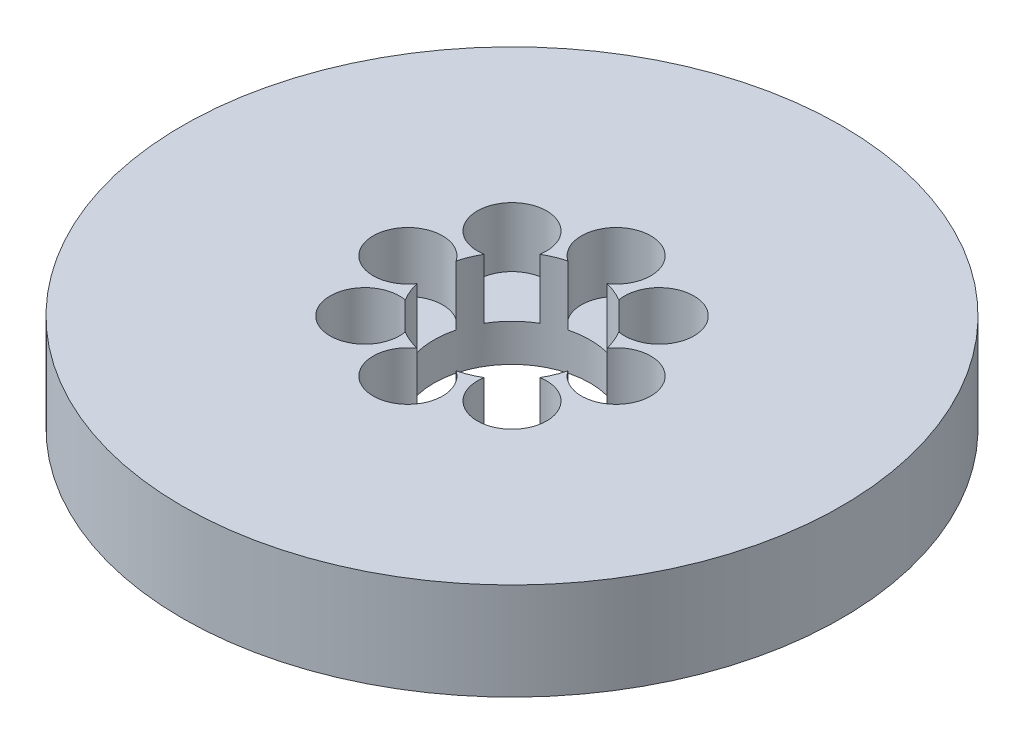
ISO-10303-21;
HEADER;
FILE_DESCRIPTION(('STEP AP214'),'2;1');
FILE_NAME('part.step','',(''),(''),'','','');
FILE_SCHEMA(('AUTOMOTIVE_DESIGN { 1 0 10303 214 1 1 1 1 }'));
ENDSEC;
DATA;
#1=APPLICATION_CONTEXT('core data for automotive mechanical design processes');
#2=APPLICATION_PROTOCOL_DEFINITION('international standard','automotive_design',2000,#1);
#3=PRODUCT_CONTEXT('',#1,'mechanical');
#4=PRODUCT('Part','Part','',(#3));
#5=PRODUCT_RELATED_PRODUCT_CATEGORY('part','',(#4));
#6=PRODUCT_DEFINITION_FORMATION('','',#4);
#7=PRODUCT_DEFINITION_CONTEXT('part definition',#1,'design');
#8=PRODUCT_DEFINITION('design','',#6,#7);
#9=PRODUCT_DEFINITION_SHAPE('','',#8);
#10=(LENGTH_UNIT() NAMED_UNIT(*) SI_UNIT(.MILLI.,.METRE.));
#11=(NAMED_UNIT(*) PLANE_ANGLE_UNIT() SI_UNIT($,.RADIAN.));
#12=(NAMED_UNIT(*) SI_UNIT($,.STERADIAN.) SOLID_ANGLE_UNIT());
#13=UNCERTAINTY_MEASURE_WITH_UNIT(LENGTH_MEASURE(1.E-05),#10,'distance_accuracy_value','');
#14=(GEOMETRIC_REPRESENTATION_CONTEXT(3) GLOBAL_UNCERTAINTY_ASSIGNED_CONTEXT((#13)) GLOBAL_UNIT_ASSIGNED_CONTEXT((#10,
#11,#12)) REPRESENTATION_CONTEXT('',''));
#15=CARTESIAN_POINT('',(0.,0.,0.));
#16=DIRECTION('',(0.,0.,1.));
#17=DIRECTION('',(1.,0.,0.));
#18=AXIS2_PLACEMENT_3D('',#15,#16,#17);
#19=CARTESIAN_POINT('',(0.,28.,0.));
#20=DIRECTION('',(0.,-1.,0.));
#21=DIRECTION('',(0.,0.,-1.));
#22=AXIS2_PLACEMENT_3D('',#19,#20,#21);
#23=CYLINDRICAL_SURFACE('',#22,95.);
#24=CARTESIAN_POINT('',(0.,28.,0.));
#25=DIRECTION('',(0.,1.,0.));
#26=DIRECTION('',(0.,0.,1.));
#27=AXIS2_PLACEMENT_3D('',#24,#25,#26);
#28=CIRCLE('',#27,95.);
#29=CARTESIAN_POINT('',(0.,28.,95.));
#30=VERTEX_POINT('',#29);
#31=EDGE_CURVE('E195',#30,#30,#28,.T.);
#32=ORIENTED_EDGE('',*,*,#31,.F.);
#33=EDGE_LOOP('',(#32));
#34=FACE_BOUND('',#33,.T.);
#35=CARTESIAN_POINT('',(0.,0.,0.));
#36=DIRECTION('',(0.,1.,0.));
#37=DIRECTION('',(0.,0.,1.));
#38=AXIS2_PLACEMENT_3D('',#35,#36,#37);
#39=CIRCLE('',#38,95.);
#40=CARTESIAN_POINT('',(0.,0.,95.));
#41=VERTEX_POINT('',#40);
#42=EDGE_CURVE('E179',#41,#41,#39,.T.);
#43=ORIENTED_EDGE('',*,*,#42,.T.);
#44=EDGE_LOOP('',(#43));
#45=FACE_BOUND('',#44,.T.);
#46=ADVANCED_FACE('F39',(#34,#45),#23,.T.);
#47=CARTESIAN_POINT('',(0.,28.,0.));
#48=DIRECTION('',(0.,1.,0.));
#49=DIRECTION('',(0.,0.,1.));
#50=AXIS2_PLACEMENT_3D('',#47,#48,#49);
#51=PLANE('',#50);
#52=CARTESIAN_POINT('',(1.04796170813175E-13,28.,30.0148162464182));
#53=DIRECTION('',(0.,1.,0.));
#54=DIRECTION('',(1.,0.,0.));
#55=AXIS2_PLACEMENT_3D('',#52,#53,#54);
#56=CIRCLE('',#55,10.);
#57=CARTESIAN_POINT('',(-5.66601857159565,28.,21.7748991627133));
#58=VERTEX_POINT('',#57);
#59=CARTESIAN_POINT('',(5.6660185715958,28.,21.7748991627133));
#60=VERTEX_POINT('',#59);
#61=EDGE_CURVE('E176',#58,#60,#56,.T.);
#62=ORIENTED_EDGE('',*,*,#61,.F.);
#63=CARTESIAN_POINT('',(0.,28.,0.));
#64=DIRECTION('',(0.,1.,0.));
#65=DIRECTION('',(0.,0.,1.));
#66=AXIS2_PLACEMENT_3D('',#63,#64,#65);
#67=CIRCLE('',#66,22.5);
#68=CARTESIAN_POINT('',(-11.3906987033036,28.,19.4036590119121));
#69=VERTEX_POINT('',#68);
#70=EDGE_CURVE('E166',#69,#58,#67,.T.);
#71=ORIENTED_EDGE('',*,*,#70,.F.);
#72=CARTESIAN_POINT('',(-21.2236801039105,28.,21.2236801039105));
#73=DIRECTION('',(0.,1.,0.));
#74=DIRECTION('',(0.707106781186549,0.,0.707106781186546));
#75=AXIS2_PLACEMENT_3D('',#72,#73,#74);
#76=CIRCLE('',#75,10.);
#77=CARTESIAN_POINT('',(-19.4036590119121,28.,11.3906987033036));
#78=VERTEX_POINT('',#77);
#79=EDGE_CURVE('E147',#78,#69,#76,.T.);
#80=ORIENTED_EDGE('',*,*,#79,.F.);
#81=CARTESIAN_POINT('',(-21.7748991627133,28.,5.66601857159572));
#82=VERTEX_POINT('',#81);
#83=EDGE_CURVE('E180',#82,#78,#67,.T.);
#84=ORIENTED_EDGE('',*,*,#83,.F.);
#85=CARTESIAN_POINT('',(-30.0148162464182,28.,0.));
#86=DIRECTION('',(0.,1.,0.));
#87=DIRECTION('',(0.,0.,1.));
#88=AXIS2_PLACEMENT_3D('',#85,#86,#87);
#89=CIRCLE('',#88,10.);
#90=CARTESIAN_POINT('',(-21.7748991627133,28.,-5.66601857159572));
#91=VERTEX_POINT('',#90);
#92=EDGE_CURVE('E186',#91,#82,#89,.T.);
#93=ORIENTED_EDGE('',*,*,#92,.F.);
#94=CARTESIAN_POINT('',(-19.4036590119122,28.,-11.3906987033034));
#95=VERTEX_POINT('',#94);
#96=EDGE_CURVE('E182',#95,#91,#67,.T.);
#97=ORIENTED_EDGE('',*,*,#96,.F.);
#98=CARTESIAN_POINT('',(-21.2236801039107,28.,-21.2236801039102));
#99=DIRECTION('',(0.,1.,0.));
#100=DIRECTION('',(-0.707106781186539,0.,0.707106781186556));
#101=AXIS2_PLACEMENT_3D('',#98,#99,#100);
#102=CIRCLE('',#101,10.);
#103=CARTESIAN_POINT('',(-11.3906987033038,28.,-19.403659011912));
#104=VERTEX_POINT('',#103);
#105=EDGE_CURVE('E446',#104,#95,#102,.T.);
#106=ORIENTED_EDGE('',*,*,#105,.F.);
#107=CARTESIAN_POINT('',(-5.66601857159595,28.,-21.7748991627132));
#108=VERTEX_POINT('',#107);
#109=EDGE_CURVE('E452',#108,#104,#67,.T.);
#110=ORIENTED_EDGE('',*,*,#109,.F.);
#111=CARTESIAN_POINT('',(-3.14388512439525E-13,28.,-30.0148162464182));
#112=DIRECTION('',(0.,1.,0.));
#113=DIRECTION('',(-1.,0.,0.));
#114=AXIS2_PLACEMENT_3D('',#111,#112,#113);
#115=CIRCLE('',#114,10.);
#116=CARTESIAN_POINT('',(5.66601857159549,28.,-21.7748991627134));
#117=VERTEX_POINT('',#116);
#118=EDGE_CURVE('E477',#117,#108,#115,.T.);
#119=ORIENTED_EDGE('',*,*,#118,.F.);
#120=CARTESIAN_POINT('',(11.3906987033034,28.,-19.4036590119122));
#121=VERTEX_POINT('',#120);
#122=EDGE_CURVE('E460',#121,#117,#67,.T.);
#123=ORIENTED_EDGE('',*,*,#122,.F.);
#124=CARTESIAN_POINT('',(21.2236801039103,28.,-21.2236801039107));
#125=DIRECTION('',(0.,1.,0.));
#126=DIRECTION('',(-0.707106781186554,0.,-0.707106781186541));
#127=AXIS2_PLACEMENT_3D('',#124,#125,#126);
#128=CIRCLE('',#127,10.);
#129=CARTESIAN_POINT('',(19.403659011912,28.,-11.3906987033038));
#130=VERTEX_POINT('',#129);
#131=EDGE_CURVE('E464',#130,#121,#128,.T.);
#132=ORIENTED_EDGE('',*,*,#131,.F.);
#133=CARTESIAN_POINT('',(21.7748991627133,28.,-5.66601857159572));
#134=VERTEX_POINT('',#133);
#135=EDGE_CURVE('E459',#134,#130,#67,.T.);
#136=ORIENTED_EDGE('',*,*,#135,.F.);
#137=CARTESIAN_POINT('',(30.0148162464182,28.,0.));
#138=DIRECTION('',(0.,1.,0.));
#139=DIRECTION('',(0.,0.,-1.));
#140=AXIS2_PLACEMENT_3D('',#137,#138,#139);
#141=CIRCLE('',#140,10.);
#142=CARTESIAN_POINT('',(21.7748991627133,28.,5.66601857159572));
#143=VERTEX_POINT('',#142);
#144=EDGE_CURVE('E469',#143,#134,#141,.T.);
#145=ORIENTED_EDGE('',*,*,#144,.F.);
#146=CARTESIAN_POINT('',(19.4036590119122,28.,11.3906987033035));
#147=VERTEX_POINT('',#146);
#148=EDGE_CURVE('E181',#147,#143,#67,.T.);
#149=ORIENTED_EDGE('',*,*,#148,.F.);
#150=CARTESIAN_POINT('',(21.2236801039106,28.,21.2236801039104));
#151=DIRECTION('',(0.,1.,0.));
#152=DIRECTION('',(0.707106781186544,0.,-0.707106781186551));
#153=AXIS2_PLACEMENT_3D('',#150,#151,#152);
#154=CIRCLE('',#153,10.);
#155=CARTESIAN_POINT('',(11.3906987033037,28.,19.403659011912));
#156=VERTEX_POINT('',#155);
#157=EDGE_CURVE('E475',#156,#147,#154,.T.);
#158=ORIENTED_EDGE('',*,*,#157,.F.);
#159=EDGE_CURVE('E177',#60,#156,#67,.T.);
#160=ORIENTED_EDGE('',*,*,#159,.F.);
#161=EDGE_LOOP('',(#62,#71,#80,#84,#93,#97,#106,#110,#119,#123,#132,#136,#145,#149,#158,#160));
#162=FACE_BOUND('',#161,.T.);
#163=ORIENTED_EDGE('',*,*,#31,.T.);
#164=EDGE_LOOP('',(#163));
#165=FACE_BOUND('',#164,.T.);
#166=ADVANCED_FACE('F172',(#162,#165),#51,.T.);
#167=CARTESIAN_POINT('',(0.,0.,0.));
#168=DIRECTION('',(0.,1.,0.));
#169=DIRECTION('',(0.,0.,1.));
#170=AXIS2_PLACEMENT_3D('',#167,#168,#169);
#171=PLANE('',#170);
#172=CARTESIAN_POINT('',(0.,0.,0.));
#173=DIRECTION('',(0.,1.,0.));
#174=DIRECTION('',(0.,0.,1.));
#175=AXIS2_PLACEMENT_3D('',#172,#173,#174);
#176=CIRCLE('',#175,22.5);
#177=CARTESIAN_POINT('',(0.,0.,22.5));
#178=VERTEX_POINT('',#177);
#179=EDGE_CURVE('E187',#178,#178,#176,.T.);
#180=ORIENTED_EDGE('',*,*,#179,.T.);
#181=EDGE_LOOP('',(#180));
#182=FACE_BOUND('',#181,.T.);
#183=ORIENTED_EDGE('',*,*,#42,.F.);
#184=EDGE_LOOP('',(#183));
#185=FACE_BOUND('',#184,.T.);
#186=ADVANCED_FACE('F270',(#182,#185),#171,.F.);
#187=CARTESIAN_POINT('',(0.,28.,0.));
#188=DIRECTION('',(0.,-1.,0.));
#189=DIRECTION('',(0.,0.,-1.));
#190=AXIS2_PLACEMENT_3D('',#187,#188,#189);
#191=CYLINDRICAL_SURFACE('',#190,22.5);
#192=DIRECTION('',(0.,1.,0.));
#193=VECTOR('',#192,1.);
#194=CARTESIAN_POINT('',(-5.66601857159565,19.384521507263,21.7748991627133));
#195=LINE('',#194,#193);
#196=CARTESIAN_POINT('',(-5.66601857159565,10.7690430145259,21.7748991627133));
#197=VERTEX_POINT('',#196);
#198=EDGE_CURVE('E11',#197,#58,#195,.T.);
#199=ORIENTED_EDGE('',*,*,#198,.F.);
#200=CARTESIAN_POINT('',(0.,10.7690430145259,0.));
#201=DIRECTION('',(0.,1.,0.));
#202=DIRECTION('',(0.,0.,1.));
#203=AXIS2_PLACEMENT_3D('',#200,#201,#202);
#204=CIRCLE('',#203,22.5);
#205=CARTESIAN_POINT('',(5.6660185715958,10.7690430145259,21.7748991627133));
#206=VERTEX_POINT('',#205);
#207=EDGE_CURVE('E250',#197,#206,#204,.T.);
#208=ORIENTED_EDGE('',*,*,#207,.T.);
#209=DIRECTION('',(0.,1.,0.));
#210=VECTOR('',#209,1.);
#211=CARTESIAN_POINT('',(5.6660185715958,19.384521507263,21.7748991627133));
#212=LINE('',#211,#210);
#213=EDGE_CURVE('E46',#60,#206,#212,.F.);
#214=ORIENTED_EDGE('',*,*,#213,.F.);
#215=ORIENTED_EDGE('',*,*,#159,.T.);
#216=DIRECTION('',(0.,1.,0.));
#217=VECTOR('',#216,1.);
#218=CARTESIAN_POINT('',(11.3906987033037,19.384521507263,19.403659011912));
#219=LINE('',#218,#217);
#220=CARTESIAN_POINT('',(11.3906987033037,10.7690430145259,19.403659011912));
#221=VERTEX_POINT('',#220);
#222=EDGE_CURVE('E244',#221,#156,#219,.T.);
#223=ORIENTED_EDGE('',*,*,#222,.F.);
#224=CARTESIAN_POINT('',(0.,10.7690430145259,0.));
#225=DIRECTION('',(0.,1.,0.));
#226=DIRECTION('',(0.,0.,1.));
#227=AXIS2_PLACEMENT_3D('',#224,#225,#226);
#228=CIRCLE('',#227,22.5);
#229=CARTESIAN_POINT('',(19.4036590119122,10.7690430145259,11.3906987033035));
#230=VERTEX_POINT('',#229);
#231=EDGE_CURVE('E238',#221,#230,#228,.T.);
#232=ORIENTED_EDGE('',*,*,#231,.T.);
#233=DIRECTION('',(0.,1.,0.));
#234=VECTOR('',#233,1.);
#235=CARTESIAN_POINT('',(19.4036590119122,19.384521507263,11.3906987033035));
#236=LINE('',#235,#234);
#237=EDGE_CURVE('E242',#147,#230,#236,.F.);
#238=ORIENTED_EDGE('',*,*,#237,.F.);
#239=ORIENTED_EDGE('',*,*,#148,.T.);
#240=DIRECTION('',(0.,1.,0.));
#241=VECTOR('',#240,1.);
#242=CARTESIAN_POINT('',(21.7748991627133,19.384521507263,5.66601857159572));
#243=LINE('',#242,#241);
#244=CARTESIAN_POINT('',(21.7748991627133,10.7690430145259,5.66601857159572));
#245=VERTEX_POINT('',#244);
#246=EDGE_CURVE('E236',#245,#143,#243,.T.);
#247=ORIENTED_EDGE('',*,*,#246,.F.);
#248=CARTESIAN_POINT('',(0.,10.7690430145259,0.));
#249=DIRECTION('',(0.,1.,0.));
#250=DIRECTION('',(0.,0.,1.));
#251=AXIS2_PLACEMENT_3D('',#248,#249,#250);
#252=CIRCLE('',#251,22.5);
#253=CARTESIAN_POINT('',(21.7748991627133,10.7690430145259,-5.66601857159572));
#254=VERTEX_POINT('',#253);
#255=EDGE_CURVE('E235',#245,#254,#252,.T.);
#256=ORIENTED_EDGE('',*,*,#255,.T.);
#257=DIRECTION('',(0.,1.,0.));
#258=VECTOR('',#257,1.);
#259=CARTESIAN_POINT('',(21.7748991627133,19.384521507263,-5.66601857159572));
#260=LINE('',#259,#258);
#261=EDGE_CURVE('E234',#134,#254,#260,.F.);
#262=ORIENTED_EDGE('',*,*,#261,.F.);
#263=ORIENTED_EDGE('',*,*,#135,.T.);
#264=DIRECTION('',(0.,1.,0.));
#265=VECTOR('',#264,1.);
#266=CARTESIAN_POINT('',(19.403659011912,19.384521507263,-11.3906987033038));
#267=LINE('',#266,#265);
#268=CARTESIAN_POINT('',(19.403659011912,10.7690430145259,-11.3906987033038));
#269=VERTEX_POINT('',#268);
#270=EDGE_CURVE('E229',#269,#130,#267,.T.);
#271=ORIENTED_EDGE('',*,*,#270,.F.);
#272=CARTESIAN_POINT('',(0.,10.7690430145259,0.));
#273=DIRECTION('',(0.,1.,0.));
#274=DIRECTION('',(0.,0.,1.));
#275=AXIS2_PLACEMENT_3D('',#272,#273,#274);
#276=CIRCLE('',#275,22.5);
#277=CARTESIAN_POINT('',(11.3906987033034,10.7690430145259,-19.4036590119122));
#278=VERTEX_POINT('',#277);
#279=EDGE_CURVE('E221',#269,#278,#276,.T.);
#280=ORIENTED_EDGE('',*,*,#279,.T.);
#281=DIRECTION('',(0.,1.,0.));
#282=VECTOR('',#281,1.);
#283=CARTESIAN_POINT('',(11.3906987033034,19.384521507263,-19.4036590119122));
#284=LINE('',#283,#282);
#285=EDGE_CURVE('E230',#121,#278,#284,.F.);
#286=ORIENTED_EDGE('',*,*,#285,.F.);
#287=ORIENTED_EDGE('',*,*,#122,.T.);
#288=DIRECTION('',(0.,1.,0.));
#289=VECTOR('',#288,1.);
#290=CARTESIAN_POINT('',(5.66601857159549,19.384521507263,-21.7748991627134));
#291=LINE('',#290,#289);
#292=CARTESIAN_POINT('',(5.66601857159549,10.7690430145259,-21.7748991627134));
#293=VERTEX_POINT('',#292);
#294=EDGE_CURVE('E225',#293,#117,#291,.T.);
#295=ORIENTED_EDGE('',*,*,#294,.F.);
#296=CARTESIAN_POINT('',(0.,10.7690430145259,0.));
#297=DIRECTION('',(0.,1.,0.));
#298=DIRECTION('',(0.,0.,1.));
#299=AXIS2_PLACEMENT_3D('',#296,#297,#298);
#300=CIRCLE('',#299,22.5);
#301=CARTESIAN_POINT('',(-5.66601857159595,10.7690430145259,-21.7748991627132));
#302=VERTEX_POINT('',#301);
#303=EDGE_CURVE('E216',#293,#302,#300,.T.);
#304=ORIENTED_EDGE('',*,*,#303,.T.);
#305=DIRECTION('',(0.,1.,0.));
#306=VECTOR('',#305,1.);
#307=CARTESIAN_POINT('',(-5.66601857159595,19.384521507263,-21.7748991627132));
#308=LINE('',#307,#306);
#309=EDGE_CURVE('E218',#108,#302,#308,.F.);
#310=ORIENTED_EDGE('',*,*,#309,.F.);
#311=ORIENTED_EDGE('',*,*,#109,.T.);
#312=DIRECTION('',(0.,1.,0.));
#313=VECTOR('',#312,1.);
#314=CARTESIAN_POINT('',(-11.3906987033038,19.384521507263,-19.403659011912));
#315=LINE('',#314,#313);
#316=CARTESIAN_POINT('',(-11.3906987033038,10.7690430145259,-19.403659011912));
#317=VERTEX_POINT('',#316);
#318=EDGE_CURVE('E212',#317,#104,#315,.T.);
#319=ORIENTED_EDGE('',*,*,#318,.F.);
#320=CARTESIAN_POINT('',(0.,10.7690430145259,0.));
#321=DIRECTION('',(0.,1.,0.));
#322=DIRECTION('',(0.,0.,1.));
#323=AXIS2_PLACEMENT_3D('',#320,#321,#322);
#324=CIRCLE('',#323,22.5);
#325=CARTESIAN_POINT('',(-19.4036590119122,10.7690430145259,-11.3906987033034));
#326=VERTEX_POINT('',#325);
#327=EDGE_CURVE('E208',#317,#326,#324,.T.);
#328=ORIENTED_EDGE('',*,*,#327,.T.);
#329=DIRECTION('',(0.,1.,0.));
#330=VECTOR('',#329,1.);
#331=CARTESIAN_POINT('',(-19.4036590119122,19.384521507263,-11.3906987033034));
#332=LINE('',#331,#330);
#333=EDGE_CURVE('E211',#95,#326,#332,.F.);
#334=ORIENTED_EDGE('',*,*,#333,.F.);
#335=ORIENTED_EDGE('',*,*,#96,.T.);
#336=DIRECTION('',(0.,1.,0.));
#337=VECTOR('',#336,1.);
#338=CARTESIAN_POINT('',(-21.7748991627133,19.384521507263,-5.66601857159572));
#339=LINE('',#338,#337);
#340=CARTESIAN_POINT('',(-21.7748991627133,10.7690430145259,-5.66601857159572));
#341=VERTEX_POINT('',#340);
#342=EDGE_CURVE('E201',#341,#91,#339,.T.);
#343=ORIENTED_EDGE('',*,*,#342,.F.);
#344=CARTESIAN_POINT('',(0.,10.7690430145259,0.));
#345=DIRECTION('',(0.,1.,0.));
#346=DIRECTION('',(0.,0.,1.));
#347=AXIS2_PLACEMENT_3D('',#344,#345,#346);
#348=CIRCLE('',#347,22.5);
#349=CARTESIAN_POINT('',(-21.7748991627133,10.7690430145259,5.66601857159572));
#350=VERTEX_POINT('',#349);
#351=EDGE_CURVE('E194',#341,#350,#348,.T.);
#352=ORIENTED_EDGE('',*,*,#351,.T.);
#353=DIRECTION('',(0.,1.,0.));
#354=VECTOR('',#353,1.);
#355=CARTESIAN_POINT('',(-21.7748991627133,19.384521507263,5.66601857159572));
#356=LINE('',#355,#354);
#357=EDGE_CURVE('E199',#82,#350,#356,.F.);
#358=ORIENTED_EDGE('',*,*,#357,.F.);
#359=ORIENTED_EDGE('',*,*,#83,.T.);
#360=DIRECTION('',(0.,1.,0.));
#361=VECTOR('',#360,1.);
#362=CARTESIAN_POINT('',(-19.4036590119121,19.384521507263,11.3906987033036));
#363=LINE('',#362,#361);
#364=CARTESIAN_POINT('',(-19.4036590119121,10.7690430145259,11.3906987033036));
#365=VERTEX_POINT('',#364);
#366=EDGE_CURVE('E160',#365,#78,#363,.T.);
#367=ORIENTED_EDGE('',*,*,#366,.F.);
#368=CARTESIAN_POINT('',(0.,10.7690430145259,0.));
#369=DIRECTION('',(0.,1.,0.));
#370=DIRECTION('',(0.,0.,1.));
#371=AXIS2_PLACEMENT_3D('',#368,#369,#370);
#372=CIRCLE('',#371,22.5);
#373=CARTESIAN_POINT('',(-11.3906987033036,10.7690430145259,19.4036590119121));
#374=VERTEX_POINT('',#373);
#375=EDGE_CURVE('E168',#365,#374,#372,.T.);
#376=ORIENTED_EDGE('',*,*,#375,.T.);
#377=DIRECTION('',(0.,1.,0.));
#378=VECTOR('',#377,1.);
#379=CARTESIAN_POINT('',(-11.3906987033036,19.384521507263,19.4036590119121));
#380=LINE('',#379,#378);
#381=EDGE_CURVE('E152',#69,#374,#380,.F.);
#382=ORIENTED_EDGE('',*,*,#381,.F.);
#383=ORIENTED_EDGE('',*,*,#70,.T.);
#384=EDGE_LOOP('',(#199,#208,#214,#215,#223,#232,#238,#239,#247,#256,#262,#263,#271,#280,#286,
#287,#295,#304,#310,#311,#319,#328,#334,#335,#343,#352,#358,#359,#367,#376,#382,#383));
#385=FACE_BOUND('',#384,.T.);
#386=ORIENTED_EDGE('',*,*,#179,.F.);
#387=EDGE_LOOP('',(#386));
#388=FACE_BOUND('',#387,.T.);
#389=ADVANCED_FACE('F170',(#385,#388),#191,.F.);
#390=CARTESIAN_POINT('',(-30.0148162464182,10.7690430145259,0.));
#391=DIRECTION('',(0.,1.,0.));
#392=DIRECTION('',(0.,0.,1.));
#393=AXIS2_PLACEMENT_3D('',#390,#391,#392);
#394=CYLINDRICAL_SURFACE('',#393,10.);
#395=ORIENTED_EDGE('',*,*,#342,.T.);
#396=ORIENTED_EDGE('',*,*,#92,.T.);
#397=ORIENTED_EDGE('',*,*,#357,.T.);
#398=CARTESIAN_POINT('',(-30.0148162464182,10.7690430145259,0.));
#399=DIRECTION('',(0.,1.,0.));
#400=DIRECTION('',(0.,0.,1.));
#401=AXIS2_PLACEMENT_3D('',#398,#399,#400);
#402=CIRCLE('',#401,10.);
#403=EDGE_CURVE('E191',#341,#350,#402,.T.);
#404=ORIENTED_EDGE('',*,*,#403,.F.);
#405=EDGE_LOOP('',(#395,#396,#397,#404));
#406=FACE_BOUND('',#405,.T.);
#407=ADVANCED_FACE('F279',(#406),#394,.F.);
#408=CARTESIAN_POINT('',(-30.0148162464182,10.7690430145259,0.));
#409=DIRECTION('',(0.,1.,0.));
#410=DIRECTION('',(0.,0.,1.));
#411=AXIS2_PLACEMENT_3D('',#408,#409,#410);
#412=PLANE('',#411);
#413=ORIENTED_EDGE('',*,*,#403,.T.);
#414=ORIENTED_EDGE('',*,*,#351,.F.);
#415=EDGE_LOOP('',(#413,#414));
#416=FACE_BOUND('',#415,.T.);
#417=ADVANCED_FACE('F285',(#416),#412,.T.);
#418=CARTESIAN_POINT('',(-21.2236801039105,10.7690430145259,21.2236801039105));
#419=DIRECTION('',(0.,1.,0.));
#420=DIRECTION('',(0.,0.,1.));
#421=AXIS2_PLACEMENT_3D('',#418,#419,#420);
#422=CYLINDRICAL_SURFACE('',#421,10.);
#423=ORIENTED_EDGE('',*,*,#366,.T.);
#424=ORIENTED_EDGE('',*,*,#79,.T.);
#425=ORIENTED_EDGE('',*,*,#381,.T.);
#426=CARTESIAN_POINT('',(-21.2236801039105,10.7690430145259,21.2236801039105));
#427=DIRECTION('',(0.,1.,0.));
#428=DIRECTION('',(0.707106781186549,0.,0.707106781186546));
#429=AXIS2_PLACEMENT_3D('',#426,#427,#428);
#430=CIRCLE('',#429,10.);
#431=EDGE_CURVE('E165',#365,#374,#430,.T.);
#432=ORIENTED_EDGE('',*,*,#431,.F.);
#433=EDGE_LOOP('',(#423,#424,#425,#432));
#434=FACE_BOUND('',#433,.T.);
#435=ADVANCED_FACE('F155',(#434),#422,.F.);
#436=CARTESIAN_POINT('',(-21.2236801039105,10.7690430145259,21.2236801039105));
#437=DIRECTION('',(0.,1.,0.));
#438=DIRECTION('',(0.707106781186549,0.,0.707106781186546));
#439=AXIS2_PLACEMENT_3D('',#436,#437,#438);
#440=PLANE('',#439);
#441=ORIENTED_EDGE('',*,*,#431,.T.);
#442=ORIENTED_EDGE('',*,*,#375,.F.);
#443=EDGE_LOOP('',(#441,#442));
#444=FACE_BOUND('',#443,.T.);
#445=ADVANCED_FACE('F288',(#444),#440,.T.);
#446=CARTESIAN_POINT('',(-21.2236801039107,10.7690430145259,-21.2236801039102));
#447=DIRECTION('',(0.,1.,0.));
#448=DIRECTION('',(0.,0.,1.));
#449=AXIS2_PLACEMENT_3D('',#446,#447,#448);
#450=CYLINDRICAL_SURFACE('',#449,10.);
#451=ORIENTED_EDGE('',*,*,#318,.T.);
#452=ORIENTED_EDGE('',*,*,#105,.T.);
#453=ORIENTED_EDGE('',*,*,#333,.T.);
#454=CARTESIAN_POINT('',(-21.2236801039107,10.7690430145259,-21.2236801039102));
#455=DIRECTION('',(0.,1.,0.));
#456=DIRECTION('',(-0.707106781186539,0.,0.707106781186556));
#457=AXIS2_PLACEMENT_3D('',#454,#455,#456);
#458=CIRCLE('',#457,10.);
#459=EDGE_CURVE('E447',#317,#326,#458,.T.);
#460=ORIENTED_EDGE('',*,*,#459,.F.);
#461=EDGE_LOOP('',(#451,#452,#453,#460));
#462=FACE_BOUND('',#461,.T.);
#463=ADVANCED_FACE('F295',(#462),#450,.F.);
#464=CARTESIAN_POINT('',(-21.2236801039107,10.7690430145259,-21.2236801039102));
#465=DIRECTION('',(0.,1.,0.));
#466=DIRECTION('',(-0.707106781186539,0.,0.707106781186556));
#467=AXIS2_PLACEMENT_3D('',#464,#465,#466);
#468=PLANE('',#467);
#469=ORIENTED_EDGE('',*,*,#459,.T.);
#470=ORIENTED_EDGE('',*,*,#327,.F.);
#471=EDGE_LOOP('',(#469,#470));
#472=FACE_BOUND('',#471,.T.);
#473=ADVANCED_FACE('F375',(#472),#468,.T.);
#474=CARTESIAN_POINT('',(-3.14388512439525E-13,10.7690430145259,-30.0148162464182));
#475=DIRECTION('',(0.,1.,0.));
#476=DIRECTION('',(0.,0.,1.));
#477=AXIS2_PLACEMENT_3D('',#474,#475,#476);
#478=CYLINDRICAL_SURFACE('',#477,10.);
#479=ORIENTED_EDGE('',*,*,#294,.T.);
#480=ORIENTED_EDGE('',*,*,#118,.T.);
#481=ORIENTED_EDGE('',*,*,#309,.T.);
#482=CARTESIAN_POINT('',(-3.14388512439525E-13,10.7690430145259,-30.0148162464182));
#483=DIRECTION('',(0.,1.,0.));
#484=DIRECTION('',(-1.,0.,0.));
#485=AXIS2_PLACEMENT_3D('',#482,#483,#484);
#486=CIRCLE('',#485,10.);
#487=EDGE_CURVE('E467',#293,#302,#486,.T.);
#488=ORIENTED_EDGE('',*,*,#487,.F.);
#489=EDGE_LOOP('',(#479,#480,#481,#488));
#490=FACE_BOUND('',#489,.T.);
#491=ADVANCED_FACE('F361',(#490),#478,.F.);
#492=CARTESIAN_POINT('',(-3.14388512439525E-13,10.7690430145259,-30.0148162464182));
#493=DIRECTION('',(0.,1.,0.));
#494=DIRECTION('',(-1.,0.,0.));
#495=AXIS2_PLACEMENT_3D('',#492,#493,#494);
#496=PLANE('',#495);
#497=ORIENTED_EDGE('',*,*,#487,.T.);
#498=ORIENTED_EDGE('',*,*,#303,.F.);
#499=EDGE_LOOP('',(#497,#498));
#500=FACE_BOUND('',#499,.T.);
#501=ADVANCED_FACE('F297',(#500),#496,.T.);
#502=CARTESIAN_POINT('',(21.2236801039103,10.7690430145259,-21.2236801039107));
#503=DIRECTION('',(0.,1.,0.));
#504=DIRECTION('',(0.,0.,1.));
#505=AXIS2_PLACEMENT_3D('',#502,#503,#504);
#506=CYLINDRICAL_SURFACE('',#505,10.);
#507=ORIENTED_EDGE('',*,*,#270,.T.);
#508=ORIENTED_EDGE('',*,*,#131,.T.);
#509=ORIENTED_EDGE('',*,*,#285,.T.);
#510=CARTESIAN_POINT('',(21.2236801039103,10.7690430145259,-21.2236801039107));
#511=DIRECTION('',(0.,1.,0.));
#512=DIRECTION('',(-0.707106781186554,0.,-0.707106781186541));
#513=AXIS2_PLACEMENT_3D('',#510,#511,#512);
#514=CIRCLE('',#513,10.);
#515=EDGE_CURVE('E470',#269,#278,#514,.T.);
#516=ORIENTED_EDGE('',*,*,#515,.F.);
#517=EDGE_LOOP('',(#507,#508,#509,#516));
#518=FACE_BOUND('',#517,.T.);
#519=ADVANCED_FACE('F294',(#518),#506,.F.);
#520=CARTESIAN_POINT('',(21.2236801039103,10.7690430145259,-21.2236801039107));
#521=DIRECTION('',(0.,1.,0.));
#522=DIRECTION('',(-0.707106781186554,0.,-0.707106781186541));
#523=AXIS2_PLACEMENT_3D('',#520,#521,#522);
#524=PLANE('',#523);
#525=ORIENTED_EDGE('',*,*,#515,.T.);
#526=ORIENTED_EDGE('',*,*,#279,.F.);
#527=EDGE_LOOP('',(#525,#526));
#528=FACE_BOUND('',#527,.T.);
#529=ADVANCED_FACE('F300',(#528),#524,.T.);
#530=CARTESIAN_POINT('',(30.0148162464182,10.7690430145259,0.));
#531=DIRECTION('',(0.,1.,0.));
#532=DIRECTION('',(0.,0.,1.));
#533=AXIS2_PLACEMENT_3D('',#530,#531,#532);
#534=CYLINDRICAL_SURFACE('',#533,10.);
#535=ORIENTED_EDGE('',*,*,#246,.T.);
#536=ORIENTED_EDGE('',*,*,#144,.T.);
#537=ORIENTED_EDGE('',*,*,#261,.T.);
#538=CARTESIAN_POINT('',(30.0148162464182,10.7690430145259,0.));
#539=DIRECTION('',(0.,1.,0.));
#540=DIRECTION('',(0.,0.,-1.));
#541=AXIS2_PLACEMENT_3D('',#538,#539,#540);
#542=CIRCLE('',#541,10.);
#543=EDGE_CURVE('E472',#245,#254,#542,.T.);
#544=ORIENTED_EDGE('',*,*,#543,.F.);
#545=EDGE_LOOP('',(#535,#536,#537,#544));
#546=FACE_BOUND('',#545,.T.);
#547=ADVANCED_FACE('F305',(#546),#534,.F.);
#548=CARTESIAN_POINT('',(30.0148162464182,10.7690430145259,0.));
#549=DIRECTION('',(0.,1.,0.));
#550=DIRECTION('',(0.,0.,-1.));
#551=AXIS2_PLACEMENT_3D('',#548,#549,#550);
#552=PLANE('',#551);
#553=ORIENTED_EDGE('',*,*,#543,.T.);
#554=ORIENTED_EDGE('',*,*,#255,.F.);
#555=EDGE_LOOP('',(#553,#554));
#556=FACE_BOUND('',#555,.T.);
#557=ADVANCED_FACE('F308',(#556),#552,.T.);
#558=CARTESIAN_POINT('',(21.2236801039106,10.7690430145259,21.2236801039104));
#559=DIRECTION('',(0.,1.,0.));
#560=DIRECTION('',(0.,0.,1.));
#561=AXIS2_PLACEMENT_3D('',#558,#559,#560);
#562=CYLINDRICAL_SURFACE('',#561,10.);
#563=ORIENTED_EDGE('',*,*,#222,.T.);
#564=ORIENTED_EDGE('',*,*,#157,.T.);
#565=ORIENTED_EDGE('',*,*,#237,.T.);
#566=CARTESIAN_POINT('',(21.2236801039106,10.7690430145259,21.2236801039104));
#567=DIRECTION('',(0.,1.,0.));
#568=DIRECTION('',(0.707106781186544,0.,-0.707106781186551));
#569=AXIS2_PLACEMENT_3D('',#566,#567,#568);
#570=CIRCLE('',#569,10.);
#571=EDGE_CURVE('E56',#221,#230,#570,.T.);
#572=ORIENTED_EDGE('',*,*,#571,.F.);
#573=EDGE_LOOP('',(#563,#564,#565,#572));
#574=FACE_BOUND('',#573,.T.);
#575=ADVANCED_FACE('F309',(#574),#562,.F.);
#576=CARTESIAN_POINT('',(21.2236801039106,10.7690430145259,21.2236801039104));
#577=DIRECTION('',(0.,1.,0.));
#578=DIRECTION('',(0.707106781186544,0.,-0.707106781186551));
#579=AXIS2_PLACEMENT_3D('',#576,#577,#578);
#580=PLANE('',#579);
#581=ORIENTED_EDGE('',*,*,#571,.T.);
#582=ORIENTED_EDGE('',*,*,#231,.F.);
#583=EDGE_LOOP('',(#581,#582));
#584=FACE_BOUND('',#583,.T.);
#585=ADVANCED_FACE('F256',(#584),#580,.T.);
#586=CARTESIAN_POINT('',(1.04796170813175E-13,10.7690430145259,30.0148162464182));
#587=DIRECTION('',(0.,1.,0.));
#588=DIRECTION('',(0.,0.,1.));
#589=AXIS2_PLACEMENT_3D('',#586,#587,#588);
#590=CYLINDRICAL_SURFACE('',#589,10.);
#591=ORIENTED_EDGE('',*,*,#198,.T.);
#592=ORIENTED_EDGE('',*,*,#61,.T.);
#593=ORIENTED_EDGE('',*,*,#213,.T.);
#594=CARTESIAN_POINT('',(1.04796170813175E-13,10.7690430145259,30.0148162464182));
#595=DIRECTION('',(0.,1.,0.));
#596=DIRECTION('',(1.,0.,0.));
#597=AXIS2_PLACEMENT_3D('',#594,#595,#596);
#598=CIRCLE('',#597,10.);
#599=EDGE_CURVE('E55',#197,#206,#598,.T.);
#600=ORIENTED_EDGE('',*,*,#599,.F.);
#601=EDGE_LOOP('',(#591,#592,#593,#600));
#602=FACE_BOUND('',#601,.T.);
#603=ADVANCED_FACE('F253',(#602),#590,.F.);
#604=CARTESIAN_POINT('',(1.04796170813175E-13,10.7690430145259,30.0148162464182));
#605=DIRECTION('',(0.,1.,0.));
#606=DIRECTION('',(1.,0.,0.));
#607=AXIS2_PLACEMENT_3D('',#604,#605,#606);
#608=PLANE('',#607);
#609=ORIENTED_EDGE('',*,*,#599,.T.);
#610=ORIENTED_EDGE('',*,*,#207,.F.);
#611=EDGE_LOOP('',(#609,#610));
#612=FACE_BOUND('',#611,.T.);
#613=ADVANCED_FACE('F252',(#612),#608,.T.);
#614=CLOSED_SHELL('',(#46,#166,#186,#389,#407,#417,#435,#445,#463,#473,#491,#501,#519,#529,#547,
#557,#575,#585,#603,#613));
#615=MANIFOLD_SOLID_BREP('B2',#614);
#616=ADVANCED_BREP_SHAPE_REPRESENTATION('',(#18,#615),#14);
#617=SHAPE_DEFINITION_REPRESENTATION(#9,#616);
ENDSEC;
END-ISO-10303-21;
